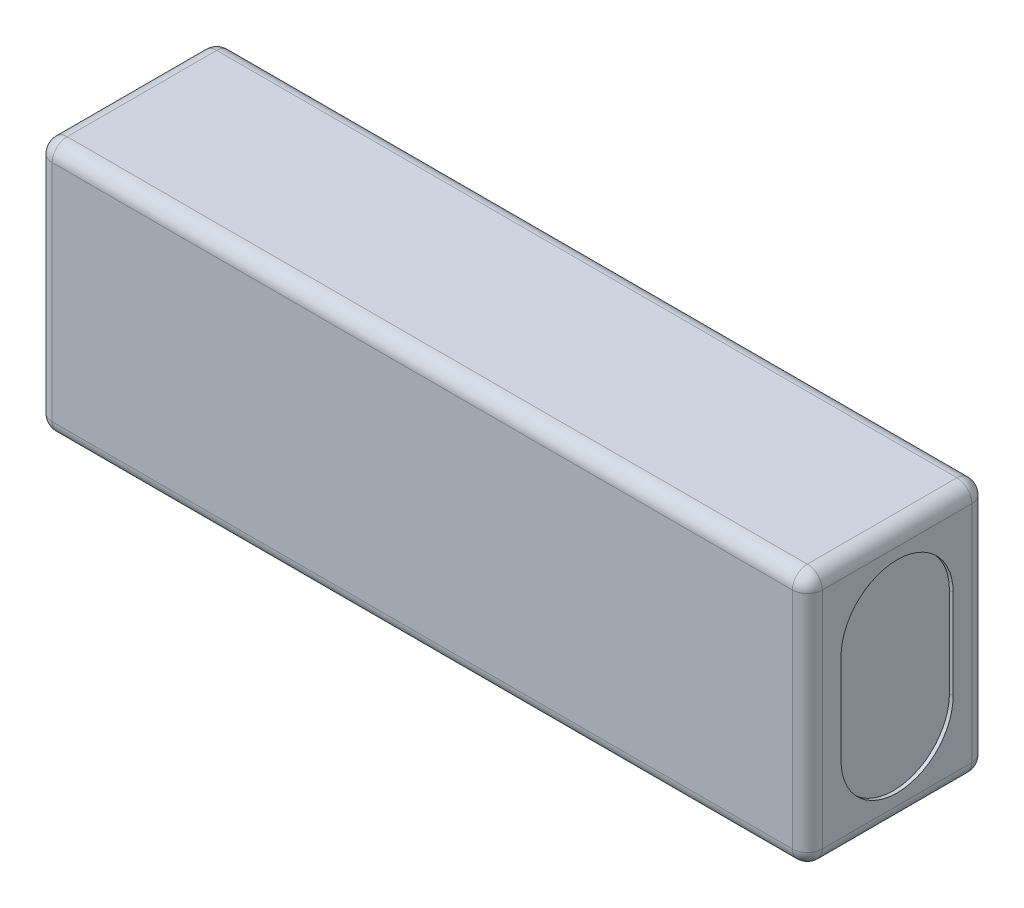
ISO-10303-21;
HEADER;
FILE_DESCRIPTION(('STEP AP214'),'2;1');
FILE_NAME('part.step','',(''),(''),'','','');
FILE_SCHEMA(('AUTOMOTIVE_DESIGN { 1 0 10303 214 1 1 1 1 }'));
ENDSEC;
DATA;
#1=APPLICATION_CONTEXT('core data for automotive mechanical design processes');
#2=APPLICATION_PROTOCOL_DEFINITION('international standard','automotive_design',2000,#1);
#3=PRODUCT_CONTEXT('',#1,'mechanical');
#4=PRODUCT('Part','Part','',(#3));
#5=PRODUCT_RELATED_PRODUCT_CATEGORY('part','',(#4));
#6=PRODUCT_DEFINITION_FORMATION('','',#4);
#7=PRODUCT_DEFINITION_CONTEXT('part definition',#1,'design');
#8=PRODUCT_DEFINITION('design','',#6,#7);
#9=PRODUCT_DEFINITION_SHAPE('','',#8);
#10=(LENGTH_UNIT() NAMED_UNIT(*) SI_UNIT(.MILLI.,.METRE.));
#11=(NAMED_UNIT(*) PLANE_ANGLE_UNIT() SI_UNIT($,.RADIAN.));
#12=(NAMED_UNIT(*) SI_UNIT($,.STERADIAN.) SOLID_ANGLE_UNIT());
#13=UNCERTAINTY_MEASURE_WITH_UNIT(LENGTH_MEASURE(1.E-05),#10,'distance_accuracy_value','');
#14=(GEOMETRIC_REPRESENTATION_CONTEXT(3) GLOBAL_UNCERTAINTY_ASSIGNED_CONTEXT((#13)) GLOBAL_UNIT_ASSIGNED_CONTEXT((#10,
#11,#12)) REPRESENTATION_CONTEXT('',''));
#15=CARTESIAN_POINT('',(0.,0.,0.));
#16=DIRECTION('',(0.,0.,1.));
#17=DIRECTION('',(1.,0.,0.));
#18=AXIS2_PLACEMENT_3D('',#15,#16,#17);
#19=CARTESIAN_POINT('',(-51.5,17.,24.));
#20=DIRECTION('',(1.,0.,0.));
#21=DIRECTION('',(0.,1.,0.));
#22=AXIS2_PLACEMENT_3D('',#19,#20,#21);
#23=PLANE('',#22);
#24=DIRECTION('',(0.,-1.,0.));
#25=VECTOR('',#24,1.);
#26=CARTESIAN_POINT('',(-51.5,17.,2.));
#27=LINE('',#26,#25);
#28=CARTESIAN_POINT('',(-51.5,15.,2.));
#29=VERTEX_POINT('',#28);
#30=CARTESIAN_POINT('',(-51.5,-15.,2.));
#31=VERTEX_POINT('',#30);
#32=EDGE_CURVE('E261',#29,#31,#27,.T.);
#33=ORIENTED_EDGE('',*,*,#32,.T.);
#34=DIRECTION('',(0.,0.,-1.));
#35=VECTOR('',#34,1.);
#36=CARTESIAN_POINT('',(-51.5,-15.,24.));
#37=LINE('',#36,#35);
#38=CARTESIAN_POINT('',(-51.5,-15.,22.));
#39=VERTEX_POINT('',#38);
#40=EDGE_CURVE('E263',#31,#39,#37,.F.);
#41=ORIENTED_EDGE('',*,*,#40,.T.);
#42=DIRECTION('',(0.,-1.,0.));
#43=VECTOR('',#42,1.);
#44=CARTESIAN_POINT('',(-51.5,17.,22.));
#45=LINE('',#44,#43);
#46=CARTESIAN_POINT('',(-51.5,15.,22.));
#47=VERTEX_POINT('',#46);
#48=EDGE_CURVE('E257',#39,#47,#45,.F.);
#49=ORIENTED_EDGE('',*,*,#48,.T.);
#50=DIRECTION('',(0.,0.,-1.));
#51=VECTOR('',#50,1.);
#52=CARTESIAN_POINT('',(-51.5,15.,24.));
#53=LINE('',#52,#51);
#54=EDGE_CURVE('E259',#47,#29,#53,.T.);
#55=ORIENTED_EDGE('',*,*,#54,.T.);
#56=EDGE_LOOP('',(#33,#41,#49,#55));
#57=FACE_BOUND('',#56,.T.);
#58=CARTESIAN_POINT('',(-51.5,6.,12.));
#59=DIRECTION('',(1.,0.,0.));
#60=DIRECTION('',(0.,1.,0.));
#61=AXIS2_PLACEMENT_3D('',#58,#59,#60);
#62=CIRCLE('',#61,7.5);
#63=CARTESIAN_POINT('',(-51.5,6.00000000000001,4.5));
#64=VERTEX_POINT('',#63);
#65=CARTESIAN_POINT('',(-51.5,6.,19.5));
#66=VERTEX_POINT('',#65);
#67=EDGE_CURVE('E194',#64,#66,#62,.T.);
#68=ORIENTED_EDGE('',*,*,#67,.T.);
#69=DIRECTION('',(0.,-1.,0.));
#70=VECTOR('',#69,1.);
#71=CARTESIAN_POINT('',(-51.5,6.,19.5));
#72=LINE('',#71,#70);
#73=CARTESIAN_POINT('',(-51.5,-6.,19.5));
#74=VERTEX_POINT('',#73);
#75=EDGE_CURVE('E198',#66,#74,#72,.T.);
#76=ORIENTED_EDGE('',*,*,#75,.T.);
#77=CARTESIAN_POINT('',(-51.5,-6.,12.));
#78=DIRECTION('',(1.,0.,0.));
#79=DIRECTION('',(0.,1.,0.));
#80=AXIS2_PLACEMENT_3D('',#77,#78,#79);
#81=CIRCLE('',#80,7.5);
#82=CARTESIAN_POINT('',(-51.5,-6.,4.5));
#83=VERTEX_POINT('',#82);
#84=EDGE_CURVE('E201',#74,#83,#81,.T.);
#85=ORIENTED_EDGE('',*,*,#84,.T.);
#86=DIRECTION('',(0.,1.,0.));
#87=VECTOR('',#86,1.);
#88=CARTESIAN_POINT('',(-51.5,6.00000000000001,4.5));
#89=LINE('',#88,#87);
#90=EDGE_CURVE('E207',#83,#64,#89,.T.);
#91=ORIENTED_EDGE('',*,*,#90,.T.);
#92=EDGE_LOOP('',(#68,#76,#85,#91));
#93=FACE_BOUND('',#92,.T.);
#94=ADVANCED_FACE('F37',(#57,#93),#23,.F.);
#95=CARTESIAN_POINT('',(51.5,17.,24.));
#96=DIRECTION('',(-1.,0.,0.));
#97=DIRECTION('',(0.,-1.,0.));
#98=AXIS2_PLACEMENT_3D('',#95,#96,#97);
#99=PLANE('',#98);
#100=DIRECTION('',(0.,1.,0.));
#101=VECTOR('',#100,1.);
#102=CARTESIAN_POINT('',(51.5,-17.,22.));
#103=LINE('',#102,#101);
#104=CARTESIAN_POINT('',(51.5,15.,22.));
#105=VERTEX_POINT('',#104);
#106=CARTESIAN_POINT('',(51.5,-15.,22.));
#107=VERTEX_POINT('',#106);
#108=EDGE_CURVE('E266',#105,#107,#103,.F.);
#109=ORIENTED_EDGE('',*,*,#108,.T.);
#110=DIRECTION('',(0.,0.,-1.));
#111=VECTOR('',#110,1.);
#112=CARTESIAN_POINT('',(51.5,-15.,24.));
#113=LINE('',#112,#111);
#114=CARTESIAN_POINT('',(51.5,-15.,2.));
#115=VERTEX_POINT('',#114);
#116=EDGE_CURVE('E272',#107,#115,#113,.T.);
#117=ORIENTED_EDGE('',*,*,#116,.T.);
#118=DIRECTION('',(0.,1.,0.));
#119=VECTOR('',#118,1.);
#120=CARTESIAN_POINT('',(51.5,17.,2.));
#121=LINE('',#120,#119);
#122=CARTESIAN_POINT('',(51.5,15.,2.));
#123=VERTEX_POINT('',#122);
#124=EDGE_CURVE('E270',#115,#123,#121,.T.);
#125=ORIENTED_EDGE('',*,*,#124,.T.);
#126=DIRECTION('',(0.,0.,-1.));
#127=VECTOR('',#126,1.);
#128=CARTESIAN_POINT('',(51.5,15.,24.));
#129=LINE('',#128,#127);
#130=EDGE_CURVE('E268',#123,#105,#129,.F.);
#131=ORIENTED_EDGE('',*,*,#130,.T.);
#132=EDGE_LOOP('',(#109,#117,#125,#131));
#133=FACE_BOUND('',#132,.T.);
#134=DIRECTION('',(0.,-1.,0.));
#135=VECTOR('',#134,1.);
#136=CARTESIAN_POINT('',(51.5,6.,19.5));
#137=LINE('',#136,#135);
#138=CARTESIAN_POINT('',(51.5,6.,19.5));
#139=VERTEX_POINT('',#138);
#140=CARTESIAN_POINT('',(51.5,-6.,19.5));
#141=VERTEX_POINT('',#140);
#142=EDGE_CURVE('E232',#139,#141,#137,.T.);
#143=ORIENTED_EDGE('',*,*,#142,.F.);
#144=CARTESIAN_POINT('',(51.5,6.,12.));
#145=DIRECTION('',(1.,0.,0.));
#146=DIRECTION('',(0.,1.,0.));
#147=AXIS2_PLACEMENT_3D('',#144,#145,#146);
#148=CIRCLE('',#147,7.5);
#149=CARTESIAN_POINT('',(51.5,6.00000000000001,4.5));
#150=VERTEX_POINT('',#149);
#151=EDGE_CURVE('E213',#150,#139,#148,.T.);
#152=ORIENTED_EDGE('',*,*,#151,.F.);
#153=DIRECTION('',(0.,1.,0.));
#154=VECTOR('',#153,1.);
#155=CARTESIAN_POINT('',(51.5,6.00000000000001,4.5));
#156=LINE('',#155,#154);
#157=CARTESIAN_POINT('',(51.5,-6.,4.5));
#158=VERTEX_POINT('',#157);
#159=EDGE_CURVE('E221',#158,#150,#156,.T.);
#160=ORIENTED_EDGE('',*,*,#159,.F.);
#161=CARTESIAN_POINT('',(51.5,-6.,12.));
#162=DIRECTION('',(1.,0.,0.));
#163=DIRECTION('',(0.,1.,0.));
#164=AXIS2_PLACEMENT_3D('',#161,#162,#163);
#165=CIRCLE('',#164,7.5);
#166=EDGE_CURVE('E235',#141,#158,#165,.T.);
#167=ORIENTED_EDGE('',*,*,#166,.F.);
#168=EDGE_LOOP('',(#143,#152,#160,#167));
#169=FACE_BOUND('',#168,.T.);
#170=ADVANCED_FACE('F400',(#133,#169),#99,.F.);
#171=CARTESIAN_POINT('',(-51.5,17.,24.));
#172=DIRECTION('',(0.,-1.,0.));
#173=DIRECTION('',(0.,0.,-1.));
#174=AXIS2_PLACEMENT_3D('',#171,#172,#173);
#175=PLANE('',#174);
#176=DIRECTION('',(0.,0.,-1.));
#177=VECTOR('',#176,1.);
#178=CARTESIAN_POINT('',(49.5,17.,24.));
#179=LINE('',#178,#177);
#180=CARTESIAN_POINT('',(49.5,17.,22.));
#181=VERTEX_POINT('',#180);
#182=CARTESIAN_POINT('',(49.5,17.,2.));
#183=VERTEX_POINT('',#182);
#184=EDGE_CURVE('E288',#181,#183,#179,.T.);
#185=ORIENTED_EDGE('',*,*,#184,.T.);
#186=DIRECTION('',(-1.,0.,0.));
#187=VECTOR('',#186,1.);
#188=CARTESIAN_POINT('',(-51.5,17.,2.));
#189=LINE('',#188,#187);
#190=CARTESIAN_POINT('',(-49.5,17.,2.));
#191=VERTEX_POINT('',#190);
#192=EDGE_CURVE('E291',#183,#191,#189,.T.);
#193=ORIENTED_EDGE('',*,*,#192,.T.);
#194=DIRECTION('',(0.,0.,-1.));
#195=VECTOR('',#194,1.);
#196=CARTESIAN_POINT('',(-49.5,17.,24.));
#197=LINE('',#196,#195);
#198=CARTESIAN_POINT('',(-49.5,17.,22.));
#199=VERTEX_POINT('',#198);
#200=EDGE_CURVE('E286',#191,#199,#197,.F.);
#201=ORIENTED_EDGE('',*,*,#200,.T.);
#202=DIRECTION('',(-1.,0.,0.));
#203=VECTOR('',#202,1.);
#204=CARTESIAN_POINT('',(51.5,17.,22.));
#205=LINE('',#204,#203);
#206=EDGE_CURVE('E284',#199,#181,#205,.F.);
#207=ORIENTED_EDGE('',*,*,#206,.T.);
#208=EDGE_LOOP('',(#185,#193,#201,#207));
#209=FACE_BOUND('',#208,.T.);
#210=ADVANCED_FACE('F415',(#209),#175,.F.);
#211=CARTESIAN_POINT('',(-51.5,-17.,24.));
#212=DIRECTION('',(0.,1.,0.));
#213=DIRECTION('',(0.,0.,1.));
#214=AXIS2_PLACEMENT_3D('',#211,#212,#213);
#215=PLANE('',#214);
#216=DIRECTION('',(0.,0.,-1.));
#217=VECTOR('',#216,1.);
#218=CARTESIAN_POINT('',(-49.5,-17.,24.));
#219=LINE('',#218,#217);
#220=CARTESIAN_POINT('',(-49.5,-17.,22.));
#221=VERTEX_POINT('',#220);
#222=CARTESIAN_POINT('',(-49.5,-17.,2.));
#223=VERTEX_POINT('',#222);
#224=EDGE_CURVE('E252',#221,#223,#219,.T.);
#225=ORIENTED_EDGE('',*,*,#224,.T.);
#226=DIRECTION('',(1.,0.,0.));
#227=VECTOR('',#226,1.);
#228=CARTESIAN_POINT('',(-51.5,-17.,2.));
#229=LINE('',#228,#227);
#230=CARTESIAN_POINT('',(49.5,-17.,2.));
#231=VERTEX_POINT('',#230);
#232=EDGE_CURVE('E255',#223,#231,#229,.T.);
#233=ORIENTED_EDGE('',*,*,#232,.T.);
#234=DIRECTION('',(0.,0.,-1.));
#235=VECTOR('',#234,1.);
#236=CARTESIAN_POINT('',(49.5,-17.,24.));
#237=LINE('',#236,#235);
#238=CARTESIAN_POINT('',(49.5,-17.,22.));
#239=VERTEX_POINT('',#238);
#240=EDGE_CURVE('E250',#231,#239,#237,.F.);
#241=ORIENTED_EDGE('',*,*,#240,.T.);
#242=DIRECTION('',(1.,0.,0.));
#243=VECTOR('',#242,1.);
#244=CARTESIAN_POINT('',(-51.5,-17.,22.));
#245=LINE('',#244,#243);
#246=EDGE_CURVE('E242',#239,#221,#245,.F.);
#247=ORIENTED_EDGE('',*,*,#246,.T.);
#248=EDGE_LOOP('',(#225,#233,#241,#247));
#249=FACE_BOUND('',#248,.T.);
#250=ADVANCED_FACE('F447',(#249),#215,.F.);
#251=CARTESIAN_POINT('',(0.,0.,24.));
#252=DIRECTION('',(0.,0.,1.));
#253=DIRECTION('',(1.,0.,0.));
#254=AXIS2_PLACEMENT_3D('',#251,#252,#253);
#255=PLANE('',#254);
#256=DIRECTION('',(0.,-1.,0.));
#257=VECTOR('',#256,1.);
#258=CARTESIAN_POINT('',(-49.5,-17.,24.));
#259=LINE('',#258,#257);
#260=CARTESIAN_POINT('',(-49.5,15.,24.));
#261=VERTEX_POINT('',#260);
#262=CARTESIAN_POINT('',(-49.5,-15.,24.));
#263=VERTEX_POINT('',#262);
#264=EDGE_CURVE('E46',#261,#263,#259,.T.);
#265=ORIENTED_EDGE('',*,*,#264,.T.);
#266=DIRECTION('',(1.,0.,0.));
#267=VECTOR('',#266,1.);
#268=CARTESIAN_POINT('',(51.5,-15.,24.));
#269=LINE('',#268,#267);
#270=CARTESIAN_POINT('',(49.5,-15.,24.));
#271=VERTEX_POINT('',#270);
#272=EDGE_CURVE('E11',#263,#271,#269,.T.);
#273=ORIENTED_EDGE('',*,*,#272,.T.);
#274=DIRECTION('',(0.,1.,0.));
#275=VECTOR('',#274,1.);
#276=CARTESIAN_POINT('',(49.5,17.,24.));
#277=LINE('',#276,#275);
#278=CARTESIAN_POINT('',(49.5,15.,24.));
#279=VERTEX_POINT('',#278);
#280=EDGE_CURVE('E293',#271,#279,#277,.T.);
#281=ORIENTED_EDGE('',*,*,#280,.T.);
#282=DIRECTION('',(-1.,0.,0.));
#283=VECTOR('',#282,1.);
#284=CARTESIAN_POINT('',(-51.5,15.,24.));
#285=LINE('',#284,#283);
#286=EDGE_CURVE('E57',#279,#261,#285,.T.);
#287=ORIENTED_EDGE('',*,*,#286,.T.);
#288=EDGE_LOOP('',(#265,#273,#281,#287));
#289=FACE_BOUND('',#288,.T.);
#290=ADVANCED_FACE('F393',(#289),#255,.T.);
#291=CARTESIAN_POINT('',(0.,0.,0.));
#292=DIRECTION('',(0.,0.,1.));
#293=DIRECTION('',(1.,0.,0.));
#294=AXIS2_PLACEMENT_3D('',#291,#292,#293);
#295=PLANE('',#294);
#296=DIRECTION('',(1.,0.,0.));
#297=VECTOR('',#296,1.);
#298=CARTESIAN_POINT('',(0.,-15.,0.));
#299=LINE('',#298,#297);
#300=CARTESIAN_POINT('',(49.5,-15.,0.));
#301=VERTEX_POINT('',#300);
#302=CARTESIAN_POINT('',(-49.5,-15.,0.));
#303=VERTEX_POINT('',#302);
#304=EDGE_CURVE('E279',#301,#303,#299,.F.);
#305=ORIENTED_EDGE('',*,*,#304,.T.);
#306=DIRECTION('',(0.,-1.,0.));
#307=VECTOR('',#306,1.);
#308=CARTESIAN_POINT('',(-49.5,0.,0.));
#309=LINE('',#308,#307);
#310=CARTESIAN_POINT('',(-49.5,15.,0.));
#311=VERTEX_POINT('',#310);
#312=EDGE_CURVE('E281',#303,#311,#309,.F.);
#313=ORIENTED_EDGE('',*,*,#312,.T.);
#314=DIRECTION('',(-1.,0.,0.));
#315=VECTOR('',#314,1.);
#316=CARTESIAN_POINT('',(0.,15.,0.));
#317=LINE('',#316,#315);
#318=CARTESIAN_POINT('',(49.5,15.,0.));
#319=VERTEX_POINT('',#318);
#320=EDGE_CURVE('E275',#311,#319,#317,.F.);
#321=ORIENTED_EDGE('',*,*,#320,.T.);
#322=DIRECTION('',(0.,1.,0.));
#323=VECTOR('',#322,1.);
#324=CARTESIAN_POINT('',(49.5,0.,0.));
#325=LINE('',#324,#323);
#326=EDGE_CURVE('E277',#319,#301,#325,.F.);
#327=ORIENTED_EDGE('',*,*,#326,.T.);
#328=EDGE_LOOP('',(#305,#313,#321,#327));
#329=FACE_BOUND('',#328,.T.);
#330=ADVANCED_FACE('F454',(#329),#295,.F.);
#331=CARTESIAN_POINT('',(51.,6.,12.));
#332=DIRECTION('',(1.,0.,0.));
#333=DIRECTION('',(0.,1.,0.));
#334=AXIS2_PLACEMENT_3D('',#331,#332,#333);
#335=CYLINDRICAL_SURFACE('',#334,7.5);
#336=ORIENTED_EDGE('',*,*,#151,.T.);
#337=DIRECTION('',(1.,0.,0.));
#338=VECTOR('',#337,1.);
#339=CARTESIAN_POINT('',(51.,6.,19.5));
#340=LINE('',#339,#338);
#341=CARTESIAN_POINT('',(51.,6.,19.5));
#342=VERTEX_POINT('',#341);
#343=EDGE_CURVE('E230',#342,#139,#340,.T.);
#344=ORIENTED_EDGE('',*,*,#343,.F.);
#345=CARTESIAN_POINT('',(51.,6.,12.));
#346=DIRECTION('',(1.,0.,0.));
#347=DIRECTION('',(0.,1.,0.));
#348=AXIS2_PLACEMENT_3D('',#345,#346,#347);
#349=CIRCLE('',#348,7.5);
#350=CARTESIAN_POINT('',(51.,6.00000000000001,4.5));
#351=VERTEX_POINT('',#350);
#352=EDGE_CURVE('E217',#351,#342,#349,.T.);
#353=ORIENTED_EDGE('',*,*,#352,.F.);
#354=DIRECTION('',(1.,0.,0.));
#355=VECTOR('',#354,1.);
#356=CARTESIAN_POINT('',(51.,6.00000000000001,4.5));
#357=LINE('',#356,#355);
#358=EDGE_CURVE('E240',#351,#150,#357,.T.);
#359=ORIENTED_EDGE('',*,*,#358,.T.);
#360=EDGE_LOOP('',(#336,#344,#353,#359));
#361=FACE_BOUND('',#360,.T.);
#362=ADVANCED_FACE('F536',(#361),#335,.F.);
#363=CARTESIAN_POINT('',(51.,6.00000000000001,4.5));
#364=DIRECTION('',(0.,0.,-1.));
#365=DIRECTION('',(0.,1.,0.));
#366=AXIS2_PLACEMENT_3D('',#363,#364,#365);
#367=PLANE('',#366);
#368=ORIENTED_EDGE('',*,*,#159,.T.);
#369=ORIENTED_EDGE('',*,*,#358,.F.);
#370=DIRECTION('',(0.,1.,0.));
#371=VECTOR('',#370,1.);
#372=CARTESIAN_POINT('',(51.,6.00000000000001,4.5));
#373=LINE('',#372,#371);
#374=CARTESIAN_POINT('',(51.,-6.,4.5));
#375=VERTEX_POINT('',#374);
#376=EDGE_CURVE('E227',#375,#351,#373,.T.);
#377=ORIENTED_EDGE('',*,*,#376,.F.);
#378=DIRECTION('',(1.,0.,0.));
#379=VECTOR('',#378,1.);
#380=CARTESIAN_POINT('',(51.,-6.,4.5));
#381=LINE('',#380,#379);
#382=EDGE_CURVE('E243',#375,#158,#381,.T.);
#383=ORIENTED_EDGE('',*,*,#382,.T.);
#384=EDGE_LOOP('',(#368,#369,#377,#383));
#385=FACE_BOUND('',#384,.T.);
#386=ADVANCED_FACE('F532',(#385),#367,.F.);
#387=CARTESIAN_POINT('',(51.,-6.,12.));
#388=DIRECTION('',(1.,0.,0.));
#389=DIRECTION('',(0.,1.,0.));
#390=AXIS2_PLACEMENT_3D('',#387,#388,#389);
#391=CYLINDRICAL_SURFACE('',#390,7.5);
#392=ORIENTED_EDGE('',*,*,#166,.T.);
#393=ORIENTED_EDGE('',*,*,#382,.F.);
#394=CARTESIAN_POINT('',(51.,-6.,12.));
#395=DIRECTION('',(1.,0.,0.));
#396=DIRECTION('',(0.,1.,0.));
#397=AXIS2_PLACEMENT_3D('',#394,#395,#396);
#398=CIRCLE('',#397,7.5);
#399=CARTESIAN_POINT('',(51.,-6.,19.5));
#400=VERTEX_POINT('',#399);
#401=EDGE_CURVE('E224',#400,#375,#398,.T.);
#402=ORIENTED_EDGE('',*,*,#401,.F.);
#403=DIRECTION('',(1.,0.,0.));
#404=VECTOR('',#403,1.);
#405=CARTESIAN_POINT('',(51.,-6.,19.5));
#406=LINE('',#405,#404);
#407=EDGE_CURVE('E245',#400,#141,#406,.T.);
#408=ORIENTED_EDGE('',*,*,#407,.T.);
#409=EDGE_LOOP('',(#392,#393,#402,#408));
#410=FACE_BOUND('',#409,.T.);
#411=ADVANCED_FACE('F535',(#410),#391,.F.);
#412=CARTESIAN_POINT('',(51.,6.,19.5));
#413=DIRECTION('',(0.,0.,1.));
#414=DIRECTION('',(0.,-1.,0.));
#415=AXIS2_PLACEMENT_3D('',#412,#413,#414);
#416=PLANE('',#415);
#417=ORIENTED_EDGE('',*,*,#142,.T.);
#418=ORIENTED_EDGE('',*,*,#407,.F.);
#419=DIRECTION('',(0.,-1.,0.));
#420=VECTOR('',#419,1.);
#421=CARTESIAN_POINT('',(51.,6.,19.5));
#422=LINE('',#421,#420);
#423=EDGE_CURVE('E220',#342,#400,#422,.T.);
#424=ORIENTED_EDGE('',*,*,#423,.F.);
#425=ORIENTED_EDGE('',*,*,#343,.T.);
#426=EDGE_LOOP('',(#417,#418,#424,#425));
#427=FACE_BOUND('',#426,.T.);
#428=ADVANCED_FACE('F530',(#427),#416,.F.);
#429=CARTESIAN_POINT('',(51.,6.,12.));
#430=DIRECTION('',(1.,0.,0.));
#431=DIRECTION('',(0.,1.,0.));
#432=AXIS2_PLACEMENT_3D('',#429,#430,#431);
#433=PLANE('',#432);
#434=ORIENTED_EDGE('',*,*,#352,.T.);
#435=ORIENTED_EDGE('',*,*,#423,.T.);
#436=ORIENTED_EDGE('',*,*,#401,.T.);
#437=ORIENTED_EDGE('',*,*,#376,.T.);
#438=EDGE_LOOP('',(#434,#435,#436,#437));
#439=FACE_BOUND('',#438,.T.);
#440=ADVANCED_FACE('F527',(#439),#433,.T.);
#441=CARTESIAN_POINT('',(-51.,6.,12.));
#442=DIRECTION('',(-1.,0.,0.));
#443=DIRECTION('',(0.,-1.,0.));
#444=AXIS2_PLACEMENT_3D('',#441,#442,#443);
#445=CYLINDRICAL_SURFACE('',#444,7.5);
#446=ORIENTED_EDGE('',*,*,#67,.F.);
#447=DIRECTION('',(-1.,0.,0.));
#448=VECTOR('',#447,1.);
#449=CARTESIAN_POINT('',(-51.,6.00000000000001,4.5));
#450=LINE('',#449,#448);
#451=CARTESIAN_POINT('',(-51.,6.00000000000001,4.5));
#452=VERTEX_POINT('',#451);
#453=EDGE_CURVE('E179',#452,#64,#450,.T.);
#454=ORIENTED_EDGE('',*,*,#453,.F.);
#455=CARTESIAN_POINT('',(-51.,6.,12.));
#456=DIRECTION('',(1.,0.,0.));
#457=DIRECTION('',(0.,1.,0.));
#458=AXIS2_PLACEMENT_3D('',#455,#456,#457);
#459=CIRCLE('',#458,7.5);
#460=CARTESIAN_POINT('',(-51.,6.,19.5));
#461=VERTEX_POINT('',#460);
#462=EDGE_CURVE('E186',#452,#461,#459,.T.);
#463=ORIENTED_EDGE('',*,*,#462,.T.);
#464=DIRECTION('',(-1.,0.,0.));
#465=VECTOR('',#464,1.);
#466=CARTESIAN_POINT('',(-51.,6.,19.5));
#467=LINE('',#466,#465);
#468=EDGE_CURVE('E211',#461,#66,#467,.T.);
#469=ORIENTED_EDGE('',*,*,#468,.T.);
#470=EDGE_LOOP('',(#446,#454,#463,#469));
#471=FACE_BOUND('',#470,.T.);
#472=ADVANCED_FACE('F190',(#471),#445,.F.);
#473=CARTESIAN_POINT('',(-51.,6.,19.5));
#474=DIRECTION('',(0.,0.,-1.));
#475=DIRECTION('',(0.,1.,0.));
#476=AXIS2_PLACEMENT_3D('',#473,#474,#475);
#477=PLANE('',#476);
#478=ORIENTED_EDGE('',*,*,#75,.F.);
#479=ORIENTED_EDGE('',*,*,#468,.F.);
#480=DIRECTION('',(0.,-1.,0.));
#481=VECTOR('',#480,1.);
#482=CARTESIAN_POINT('',(-51.,6.,19.5));
#483=LINE('',#482,#481);
#484=CARTESIAN_POINT('',(-51.,-6.,19.5));
#485=VERTEX_POINT('',#484);
#486=EDGE_CURVE('E195',#461,#485,#483,.T.);
#487=ORIENTED_EDGE('',*,*,#486,.T.);
#488=DIRECTION('',(-1.,0.,0.));
#489=VECTOR('',#488,1.);
#490=CARTESIAN_POINT('',(-51.,-6.,19.5));
#491=LINE('',#490,#489);
#492=EDGE_CURVE('E214',#485,#74,#491,.T.);
#493=ORIENTED_EDGE('',*,*,#492,.T.);
#494=EDGE_LOOP('',(#478,#479,#487,#493));
#495=FACE_BOUND('',#494,.T.);
#496=ADVANCED_FACE('F518',(#495),#477,.T.);
#497=CARTESIAN_POINT('',(-51.,-6.,12.));
#498=DIRECTION('',(-1.,0.,0.));
#499=DIRECTION('',(0.,-1.,0.));
#500=AXIS2_PLACEMENT_3D('',#497,#498,#499);
#501=CYLINDRICAL_SURFACE('',#500,7.5);
#502=ORIENTED_EDGE('',*,*,#84,.F.);
#503=ORIENTED_EDGE('',*,*,#492,.F.);
#504=CARTESIAN_POINT('',(-51.,-6.,12.));
#505=DIRECTION('',(1.,0.,0.));
#506=DIRECTION('',(0.,1.,0.));
#507=AXIS2_PLACEMENT_3D('',#504,#505,#506);
#508=CIRCLE('',#507,7.5);
#509=CARTESIAN_POINT('',(-51.,-6.,4.5));
#510=VERTEX_POINT('',#509);
#511=EDGE_CURVE('E185',#485,#510,#508,.T.);
#512=ORIENTED_EDGE('',*,*,#511,.T.);
#513=DIRECTION('',(-1.,0.,0.));
#514=VECTOR('',#513,1.);
#515=CARTESIAN_POINT('',(-51.,-6.,4.5));
#516=LINE('',#515,#514);
#517=EDGE_CURVE('E181',#510,#83,#516,.T.);
#518=ORIENTED_EDGE('',*,*,#517,.T.);
#519=EDGE_LOOP('',(#502,#503,#512,#518));
#520=FACE_BOUND('',#519,.T.);
#521=ADVANCED_FACE('F515',(#520),#501,.F.);
#522=CARTESIAN_POINT('',(-51.,6.00000000000001,4.5));
#523=DIRECTION('',(0.,0.,1.));
#524=DIRECTION('',(0.,-1.,0.));
#525=AXIS2_PLACEMENT_3D('',#522,#523,#524);
#526=PLANE('',#525);
#527=ORIENTED_EDGE('',*,*,#90,.F.);
#528=ORIENTED_EDGE('',*,*,#517,.F.);
#529=DIRECTION('',(0.,1.,0.));
#530=VECTOR('',#529,1.);
#531=CARTESIAN_POINT('',(-51.,6.00000000000001,4.5));
#532=LINE('',#531,#530);
#533=EDGE_CURVE('E175',#510,#452,#532,.T.);
#534=ORIENTED_EDGE('',*,*,#533,.T.);
#535=ORIENTED_EDGE('',*,*,#453,.T.);
#536=EDGE_LOOP('',(#527,#528,#534,#535));
#537=FACE_BOUND('',#536,.T.);
#538=ADVANCED_FACE('F178',(#537),#526,.T.);
#539=CARTESIAN_POINT('',(-51.,6.,12.));
#540=DIRECTION('',(-1.,0.,0.));
#541=DIRECTION('',(0.,1.,0.));
#542=AXIS2_PLACEMENT_3D('',#539,#540,#541);
#543=PLANE('',#542);
#544=ORIENTED_EDGE('',*,*,#462,.F.);
#545=ORIENTED_EDGE('',*,*,#533,.F.);
#546=ORIENTED_EDGE('',*,*,#511,.F.);
#547=ORIENTED_EDGE('',*,*,#486,.F.);
#548=EDGE_LOOP('',(#544,#545,#546,#547));
#549=FACE_BOUND('',#548,.T.);
#550=ADVANCED_FACE('F197',(#549),#543,.T.);
#551=CARTESIAN_POINT('',(49.5,15.,24.));
#552=DIRECTION('',(0.,0.,-1.));
#553=DIRECTION('',(-1.,0.,0.));
#554=AXIS2_PLACEMENT_3D('',#551,#552,#553);
#555=CYLINDRICAL_SURFACE('',#554,2.);
#556=CARTESIAN_POINT('',(49.5,15.,22.));
#557=DIRECTION('',(0.,0.,1.));
#558=DIRECTION('',(1.,0.,0.));
#559=AXIS2_PLACEMENT_3D('',#556,#557,#558);
#560=CIRCLE('',#559,2.);
#561=EDGE_CURVE('E41',#105,#181,#560,.T.);
#562=ORIENTED_EDGE('',*,*,#561,.F.);
#563=ORIENTED_EDGE('',*,*,#130,.F.);
#564=CARTESIAN_POINT('',(49.5,15.,2.));
#565=DIRECTION('',(0.,0.,-1.));
#566=DIRECTION('',(-1.,0.,0.));
#567=AXIS2_PLACEMENT_3D('',#564,#565,#566);
#568=CIRCLE('',#567,2.);
#569=EDGE_CURVE('E357',#183,#123,#568,.T.);
#570=ORIENTED_EDGE('',*,*,#569,.F.);
#571=ORIENTED_EDGE('',*,*,#184,.F.);
#572=EDGE_LOOP('',(#562,#563,#570,#571));
#573=FACE_BOUND('',#572,.T.);
#574=ADVANCED_FACE('F39',(#573),#555,.T.);
#575=CARTESIAN_POINT('',(49.5,15.,22.));
#576=DIRECTION('',(0.,0.,1.));
#577=DIRECTION('',(1.,0.,0.));
#578=AXIS2_PLACEMENT_3D('',#575,#576,#577);
#579=SPHERICAL_SURFACE('',#578,2.);
#580=CARTESIAN_POINT('',(49.5,15.,22.));
#581=DIRECTION('',(0.,1.,0.));
#582=DIRECTION('',(0.,0.,1.));
#583=AXIS2_PLACEMENT_3D('',#580,#581,#582);
#584=CIRCLE('',#583,2.);
#585=EDGE_CURVE('E352',#105,#279,#584,.F.);
#586=ORIENTED_EDGE('',*,*,#585,.F.);
#587=ORIENTED_EDGE('',*,*,#561,.T.);
#588=CARTESIAN_POINT('',(49.5,15.,22.));
#589=DIRECTION('',(1.,0.,0.));
#590=DIRECTION('',(0.,0.,-1.));
#591=AXIS2_PLACEMENT_3D('',#588,#589,#590);
#592=CIRCLE('',#591,2.);
#593=EDGE_CURVE('E355',#279,#181,#592,.F.);
#594=ORIENTED_EDGE('',*,*,#593,.F.);
#595=EDGE_LOOP('',(#586,#587,#594));
#596=FACE_BOUND('',#595,.T.);
#597=ADVANCED_FACE('F368',(#596),#579,.T.);
#598=CARTESIAN_POINT('',(49.5,15.,2.));
#599=DIRECTION('',(0.,0.,1.));
#600=DIRECTION('',(1.,0.,0.));
#601=AXIS2_PLACEMENT_3D('',#598,#599,#600);
#602=SPHERICAL_SURFACE('',#601,2.);
#603=CARTESIAN_POINT('',(49.5,15.,2.));
#604=DIRECTION('',(1.,0.,0.));
#605=DIRECTION('',(0.,0.,-1.));
#606=AXIS2_PLACEMENT_3D('',#603,#604,#605);
#607=CIRCLE('',#606,2.);
#608=EDGE_CURVE('E346',#183,#319,#607,.F.);
#609=ORIENTED_EDGE('',*,*,#608,.F.);
#610=ORIENTED_EDGE('',*,*,#569,.T.);
#611=CARTESIAN_POINT('',(49.5,15.,2.));
#612=DIRECTION('',(0.,1.,0.));
#613=DIRECTION('',(0.,0.,1.));
#614=AXIS2_PLACEMENT_3D('',#611,#612,#613);
#615=CIRCLE('',#614,2.);
#616=EDGE_CURVE('E349',#319,#123,#615,.F.);
#617=ORIENTED_EDGE('',*,*,#616,.F.);
#618=EDGE_LOOP('',(#609,#610,#617));
#619=FACE_BOUND('',#618,.T.);
#620=ADVANCED_FACE('F502',(#619),#602,.T.);
#621=CARTESIAN_POINT('',(0.,15.,22.));
#622=DIRECTION('',(1.,0.,0.));
#623=DIRECTION('',(0.,0.,-1.));
#624=AXIS2_PLACEMENT_3D('',#621,#622,#623);
#625=CYLINDRICAL_SURFACE('',#624,2.);
#626=ORIENTED_EDGE('',*,*,#593,.T.);
#627=ORIENTED_EDGE('',*,*,#206,.F.);
#628=CARTESIAN_POINT('',(-49.5,15.,22.));
#629=DIRECTION('',(-1.,0.,0.));
#630=DIRECTION('',(0.,0.,1.));
#631=AXIS2_PLACEMENT_3D('',#628,#629,#630);
#632=CIRCLE('',#631,2.);
#633=EDGE_CURVE('E340',#261,#199,#632,.T.);
#634=ORIENTED_EDGE('',*,*,#633,.F.);
#635=ORIENTED_EDGE('',*,*,#286,.F.);
#636=EDGE_LOOP('',(#626,#627,#634,#635));
#637=FACE_BOUND('',#636,.T.);
#638=ADVANCED_FACE('F375',(#637),#625,.T.);
#639=CARTESIAN_POINT('',(49.5,0.,22.));
#640=DIRECTION('',(0.,-1.,0.));
#641=DIRECTION('',(1.,0.,0.));
#642=AXIS2_PLACEMENT_3D('',#639,#640,#641);
#643=CYLINDRICAL_SURFACE('',#642,2.);
#644=ORIENTED_EDGE('',*,*,#585,.T.);
#645=ORIENTED_EDGE('',*,*,#280,.F.);
#646=CARTESIAN_POINT('',(49.5,-15.,22.));
#647=DIRECTION('',(0.,-1.,0.));
#648=DIRECTION('',(0.,0.,-1.));
#649=AXIS2_PLACEMENT_3D('',#646,#647,#648);
#650=CIRCLE('',#649,2.);
#651=EDGE_CURVE('E337',#107,#271,#650,.T.);
#652=ORIENTED_EDGE('',*,*,#651,.F.);
#653=ORIENTED_EDGE('',*,*,#108,.F.);
#654=EDGE_LOOP('',(#644,#645,#652,#653));
#655=FACE_BOUND('',#654,.T.);
#656=ADVANCED_FACE('F397',(#655),#643,.T.);
#657=CARTESIAN_POINT('',(49.5,-15.,24.));
#658=DIRECTION('',(0.,0.,-1.));
#659=DIRECTION('',(-1.,0.,0.));
#660=AXIS2_PLACEMENT_3D('',#657,#658,#659);
#661=CYLINDRICAL_SURFACE('',#660,2.);
#662=CARTESIAN_POINT('',(49.5,-15.,2.));
#663=DIRECTION('',(0.,0.,-1.));
#664=DIRECTION('',(-1.,0.,0.));
#665=AXIS2_PLACEMENT_3D('',#662,#663,#664);
#666=CIRCLE('',#665,2.);
#667=EDGE_CURVE('E331',#115,#231,#666,.T.);
#668=ORIENTED_EDGE('',*,*,#667,.F.);
#669=ORIENTED_EDGE('',*,*,#116,.F.);
#670=CARTESIAN_POINT('',(49.5,-15.,22.));
#671=DIRECTION('',(0.,0.,1.));
#672=DIRECTION('',(1.,0.,0.));
#673=AXIS2_PLACEMENT_3D('',#670,#671,#672);
#674=CIRCLE('',#673,2.);
#675=EDGE_CURVE('E334',#239,#107,#674,.T.);
#676=ORIENTED_EDGE('',*,*,#675,.F.);
#677=ORIENTED_EDGE('',*,*,#240,.F.);
#678=EDGE_LOOP('',(#668,#669,#676,#677));
#679=FACE_BOUND('',#678,.T.);
#680=ADVANCED_FACE('F405',(#679),#661,.T.);
#681=CARTESIAN_POINT('',(49.5,17.,2.));
#682=DIRECTION('',(0.,1.,0.));
#683=DIRECTION('',(-1.,0.,0.));
#684=AXIS2_PLACEMENT_3D('',#681,#682,#683);
#685=CYLINDRICAL_SURFACE('',#684,2.);
#686=ORIENTED_EDGE('',*,*,#616,.T.);
#687=ORIENTED_EDGE('',*,*,#124,.F.);
#688=CARTESIAN_POINT('',(49.5,-15.,2.));
#689=DIRECTION('',(0.,-1.,0.));
#690=DIRECTION('',(1.,0.,0.));
#691=AXIS2_PLACEMENT_3D('',#688,#689,#690);
#692=CIRCLE('',#691,2.);
#693=EDGE_CURVE('E329',#301,#115,#692,.T.);
#694=ORIENTED_EDGE('',*,*,#693,.F.);
#695=ORIENTED_EDGE('',*,*,#326,.F.);
#696=EDGE_LOOP('',(#686,#687,#694,#695));
#697=FACE_BOUND('',#696,.T.);
#698=ADVANCED_FACE('F412',(#697),#685,.T.);
#699=CARTESIAN_POINT('',(-51.5,15.,2.));
#700=DIRECTION('',(-1.,0.,0.));
#701=DIRECTION('',(0.,0.,1.));
#702=AXIS2_PLACEMENT_3D('',#699,#700,#701);
#703=CYLINDRICAL_SURFACE('',#702,2.);
#704=ORIENTED_EDGE('',*,*,#608,.T.);
#705=ORIENTED_EDGE('',*,*,#320,.F.);
#706=CARTESIAN_POINT('',(-49.5,15.,2.));
#707=DIRECTION('',(-1.,0.,0.));
#708=DIRECTION('',(0.,0.,1.));
#709=AXIS2_PLACEMENT_3D('',#706,#707,#708);
#710=CIRCLE('',#709,2.);
#711=EDGE_CURVE('E326',#191,#311,#710,.T.);
#712=ORIENTED_EDGE('',*,*,#711,.F.);
#713=ORIENTED_EDGE('',*,*,#192,.F.);
#714=EDGE_LOOP('',(#704,#705,#712,#713));
#715=FACE_BOUND('',#714,.T.);
#716=ADVANCED_FACE('F425',(#715),#703,.T.);
#717=CARTESIAN_POINT('',(-49.5,15.,24.));
#718=DIRECTION('',(0.,0.,-1.));
#719=DIRECTION('',(-1.,0.,0.));
#720=AXIS2_PLACEMENT_3D('',#717,#718,#719);
#721=CYLINDRICAL_SURFACE('',#720,2.);
#722=CARTESIAN_POINT('',(-49.5,15.,22.));
#723=DIRECTION('',(0.,0.,1.));
#724=DIRECTION('',(1.,0.,0.));
#725=AXIS2_PLACEMENT_3D('',#722,#723,#724);
#726=CIRCLE('',#725,2.);
#727=EDGE_CURVE('E343',#199,#47,#726,.T.);
#728=ORIENTED_EDGE('',*,*,#727,.F.);
#729=ORIENTED_EDGE('',*,*,#200,.F.);
#730=CARTESIAN_POINT('',(-49.5,15.,2.));
#731=DIRECTION('',(0.,0.,-1.));
#732=DIRECTION('',(-1.,0.,0.));
#733=AXIS2_PLACEMENT_3D('',#730,#731,#732);
#734=CIRCLE('',#733,2.);
#735=EDGE_CURVE('E323',#29,#191,#734,.T.);
#736=ORIENTED_EDGE('',*,*,#735,.F.);
#737=ORIENTED_EDGE('',*,*,#54,.F.);
#738=EDGE_LOOP('',(#728,#729,#736,#737));
#739=FACE_BOUND('',#738,.T.);
#740=ADVANCED_FACE('F420',(#739),#721,.T.);
#741=CARTESIAN_POINT('',(-49.5,15.,22.));
#742=DIRECTION('',(0.,0.,1.));
#743=DIRECTION('',(1.,0.,0.));
#744=AXIS2_PLACEMENT_3D('',#741,#742,#743);
#745=SPHERICAL_SURFACE('',#744,2.);
#746=ORIENTED_EDGE('',*,*,#633,.T.);
#747=ORIENTED_EDGE('',*,*,#727,.T.);
#748=CARTESIAN_POINT('',(-49.5,15.,22.));
#749=DIRECTION('',(0.,1.,0.));
#750=DIRECTION('',(0.,0.,1.));
#751=AXIS2_PLACEMENT_3D('',#748,#749,#750);
#752=CIRCLE('',#751,2.);
#753=EDGE_CURVE('E320',#261,#47,#752,.F.);
#754=ORIENTED_EDGE('',*,*,#753,.F.);
#755=EDGE_LOOP('',(#746,#747,#754));
#756=FACE_BOUND('',#755,.T.);
#757=ADVANCED_FACE('F379',(#756),#745,.T.);
#758=CARTESIAN_POINT('',(49.5,-15.,22.));
#759=DIRECTION('',(0.,0.,1.));
#760=DIRECTION('',(1.,0.,0.));
#761=AXIS2_PLACEMENT_3D('',#758,#759,#760);
#762=SPHERICAL_SURFACE('',#761,2.);
#763=ORIENTED_EDGE('',*,*,#675,.T.);
#764=ORIENTED_EDGE('',*,*,#651,.T.);
#765=CARTESIAN_POINT('',(49.5,-15.,22.));
#766=DIRECTION('',(1.,0.,0.));
#767=DIRECTION('',(0.,0.,-1.));
#768=AXIS2_PLACEMENT_3D('',#765,#766,#767);
#769=CIRCLE('',#768,2.);
#770=EDGE_CURVE('E318',#239,#271,#769,.F.);
#771=ORIENTED_EDGE('',*,*,#770,.F.);
#772=EDGE_LOOP('',(#763,#764,#771));
#773=FACE_BOUND('',#772,.T.);
#774=ADVANCED_FACE('F484',(#773),#762,.T.);
#775=CARTESIAN_POINT('',(49.5,-15.,2.));
#776=DIRECTION('',(0.,0.,1.));
#777=DIRECTION('',(1.,0.,0.));
#778=AXIS2_PLACEMENT_3D('',#775,#776,#777);
#779=SPHERICAL_SURFACE('',#778,2.);
#780=ORIENTED_EDGE('',*,*,#693,.T.);
#781=ORIENTED_EDGE('',*,*,#667,.T.);
#782=CARTESIAN_POINT('',(49.5,-15.,2.));
#783=DIRECTION('',(1.,0.,0.));
#784=DIRECTION('',(0.,0.,-1.));
#785=AXIS2_PLACEMENT_3D('',#782,#783,#784);
#786=CIRCLE('',#785,2.);
#787=EDGE_CURVE('E315',#301,#231,#786,.F.);
#788=ORIENTED_EDGE('',*,*,#787,.F.);
#789=EDGE_LOOP('',(#780,#781,#788));
#790=FACE_BOUND('',#789,.T.);
#791=ADVANCED_FACE('F481',(#790),#779,.T.);
#792=CARTESIAN_POINT('',(-49.5,15.,2.));
#793=DIRECTION('',(0.,0.,1.));
#794=DIRECTION('',(1.,0.,0.));
#795=AXIS2_PLACEMENT_3D('',#792,#793,#794);
#796=SPHERICAL_SURFACE('',#795,2.);
#797=ORIENTED_EDGE('',*,*,#735,.T.);
#798=ORIENTED_EDGE('',*,*,#711,.T.);
#799=CARTESIAN_POINT('',(-49.5,15.,2.));
#800=DIRECTION('',(0.,1.,0.));
#801=DIRECTION('',(0.,0.,1.));
#802=AXIS2_PLACEMENT_3D('',#799,#800,#801);
#803=CIRCLE('',#802,2.);
#804=EDGE_CURVE('E313',#29,#311,#803,.F.);
#805=ORIENTED_EDGE('',*,*,#804,.F.);
#806=EDGE_LOOP('',(#797,#798,#805));
#807=FACE_BOUND('',#806,.T.);
#808=ADVANCED_FACE('F427',(#807),#796,.T.);
#809=CARTESIAN_POINT('',(-49.5,0.,22.));
#810=DIRECTION('',(0.,1.,0.));
#811=DIRECTION('',(-1.,0.,0.));
#812=AXIS2_PLACEMENT_3D('',#809,#810,#811);
#813=CYLINDRICAL_SURFACE('',#812,2.);
#814=ORIENTED_EDGE('',*,*,#753,.T.);
#815=ORIENTED_EDGE('',*,*,#48,.F.);
#816=CARTESIAN_POINT('',(-49.5,-15.,22.));
#817=DIRECTION('',(0.,-1.,0.));
#818=DIRECTION('',(0.,0.,-1.));
#819=AXIS2_PLACEMENT_3D('',#816,#817,#818);
#820=CIRCLE('',#819,2.);
#821=EDGE_CURVE('E310',#263,#39,#820,.T.);
#822=ORIENTED_EDGE('',*,*,#821,.F.);
#823=ORIENTED_EDGE('',*,*,#264,.F.);
#824=EDGE_LOOP('',(#814,#815,#822,#823));
#825=FACE_BOUND('',#824,.T.);
#826=ADVANCED_FACE('F383',(#825),#813,.T.);
#827=CARTESIAN_POINT('',(0.,-15.,22.));
#828=DIRECTION('',(-1.,0.,0.));
#829=DIRECTION('',(0.,0.,1.));
#830=AXIS2_PLACEMENT_3D('',#827,#828,#829);
#831=CYLINDRICAL_SURFACE('',#830,2.);
#832=ORIENTED_EDGE('',*,*,#770,.T.);
#833=ORIENTED_EDGE('',*,*,#272,.F.);
#834=CARTESIAN_POINT('',(-49.5,-15.,22.));
#835=DIRECTION('',(-1.,0.,0.));
#836=DIRECTION('',(0.,0.,1.));
#837=AXIS2_PLACEMENT_3D('',#834,#835,#836);
#838=CIRCLE('',#837,2.);
#839=EDGE_CURVE('E307',#221,#263,#838,.T.);
#840=ORIENTED_EDGE('',*,*,#839,.F.);
#841=ORIENTED_EDGE('',*,*,#246,.F.);
#842=EDGE_LOOP('',(#832,#833,#840,#841));
#843=FACE_BOUND('',#842,.T.);
#844=ADVANCED_FACE('F391',(#843),#831,.T.);
#845=CARTESIAN_POINT('',(-51.5,-15.,2.));
#846=DIRECTION('',(1.,0.,0.));
#847=DIRECTION('',(0.,0.,-1.));
#848=AXIS2_PLACEMENT_3D('',#845,#846,#847);
#849=CYLINDRICAL_SURFACE('',#848,2.);
#850=ORIENTED_EDGE('',*,*,#787,.T.);
#851=ORIENTED_EDGE('',*,*,#232,.F.);
#852=CARTESIAN_POINT('',(-49.5,-15.,2.));
#853=DIRECTION('',(-1.,0.,0.));
#854=DIRECTION('',(0.,0.,1.));
#855=AXIS2_PLACEMENT_3D('',#852,#853,#854);
#856=CIRCLE('',#855,2.);
#857=EDGE_CURVE('E304',#303,#223,#856,.T.);
#858=ORIENTED_EDGE('',*,*,#857,.F.);
#859=ORIENTED_EDGE('',*,*,#304,.F.);
#860=EDGE_LOOP('',(#850,#851,#858,#859));
#861=FACE_BOUND('',#860,.T.);
#862=ADVANCED_FACE('F445',(#861),#849,.T.);
#863=CARTESIAN_POINT('',(-49.5,17.,2.));
#864=DIRECTION('',(0.,-1.,0.));
#865=DIRECTION('',(1.,0.,0.));
#866=AXIS2_PLACEMENT_3D('',#863,#864,#865);
#867=CYLINDRICAL_SURFACE('',#866,2.);
#868=ORIENTED_EDGE('',*,*,#804,.T.);
#869=ORIENTED_EDGE('',*,*,#312,.F.);
#870=CARTESIAN_POINT('',(-49.5,-15.,2.));
#871=DIRECTION('',(0.,-1.,0.));
#872=DIRECTION('',(0.,0.,-1.));
#873=AXIS2_PLACEMENT_3D('',#870,#871,#872);
#874=CIRCLE('',#873,2.);
#875=EDGE_CURVE('E301',#31,#303,#874,.T.);
#876=ORIENTED_EDGE('',*,*,#875,.F.);
#877=ORIENTED_EDGE('',*,*,#32,.F.);
#878=EDGE_LOOP('',(#868,#869,#876,#877));
#879=FACE_BOUND('',#878,.T.);
#880=ADVANCED_FACE('F432',(#879),#867,.T.);
#881=CARTESIAN_POINT('',(-49.5,-15.,22.));
#882=DIRECTION('',(0.,0.,1.));
#883=DIRECTION('',(1.,0.,0.));
#884=AXIS2_PLACEMENT_3D('',#881,#882,#883);
#885=SPHERICAL_SURFACE('',#884,2.);
#886=ORIENTED_EDGE('',*,*,#839,.T.);
#887=ORIENTED_EDGE('',*,*,#821,.T.);
#888=CARTESIAN_POINT('',(-49.5,-15.,22.));
#889=DIRECTION('',(0.,0.,1.));
#890=DIRECTION('',(1.,0.,0.));
#891=AXIS2_PLACEMENT_3D('',#888,#889,#890);
#892=CIRCLE('',#891,2.);
#893=EDGE_CURVE('E299',#221,#39,#892,.F.);
#894=ORIENTED_EDGE('',*,*,#893,.F.);
#895=EDGE_LOOP('',(#886,#887,#894));
#896=FACE_BOUND('',#895,.T.);
#897=ADVANCED_FACE('F387',(#896),#885,.T.);
#898=CARTESIAN_POINT('',(-49.5,-15.,2.));
#899=DIRECTION('',(0.,0.,1.));
#900=DIRECTION('',(1.,0.,0.));
#901=AXIS2_PLACEMENT_3D('',#898,#899,#900);
#902=SPHERICAL_SURFACE('',#901,2.);
#903=ORIENTED_EDGE('',*,*,#875,.T.);
#904=ORIENTED_EDGE('',*,*,#857,.T.);
#905=CARTESIAN_POINT('',(-49.5,-15.,2.));
#906=DIRECTION('',(0.,0.,-1.));
#907=DIRECTION('',(-1.,0.,0.));
#908=AXIS2_PLACEMENT_3D('',#905,#906,#907);
#909=CIRCLE('',#908,2.);
#910=EDGE_CURVE('E297',#31,#223,#909,.F.);
#911=ORIENTED_EDGE('',*,*,#910,.F.);
#912=EDGE_LOOP('',(#903,#904,#911));
#913=FACE_BOUND('',#912,.T.);
#914=ADVANCED_FACE('F440',(#913),#902,.T.);
#915=CARTESIAN_POINT('',(-49.5,-15.,24.));
#916=DIRECTION('',(0.,0.,-1.));
#917=DIRECTION('',(-1.,0.,0.));
#918=AXIS2_PLACEMENT_3D('',#915,#916,#917);
#919=CYLINDRICAL_SURFACE('',#918,2.);
#920=ORIENTED_EDGE('',*,*,#893,.T.);
#921=ORIENTED_EDGE('',*,*,#40,.F.);
#922=ORIENTED_EDGE('',*,*,#910,.T.);
#923=ORIENTED_EDGE('',*,*,#224,.F.);
#924=EDGE_LOOP('',(#920,#921,#922,#923));
#925=FACE_BOUND('',#924,.T.);
#926=ADVANCED_FACE('F438',(#925),#919,.T.);
#927=CLOSED_SHELL('',(#94,#170,#210,#250,#290,#330,#362,#386,#411,#428,#440,#472,#496,#521,#538,
#550,#574,#597,#620,#638,#656,#680,#698,#716,#740,#757,#774,#791,#808,#826,#844,#862,#880,#897,
#914,#926));
#928=MANIFOLD_SOLID_BREP('B2',#927);
#929=ADVANCED_BREP_SHAPE_REPRESENTATION('',(#18,#928),#14);
#930=SHAPE_DEFINITION_REPRESENTATION(#9,#929);
ENDSEC;
END-ISO-10303-21;
